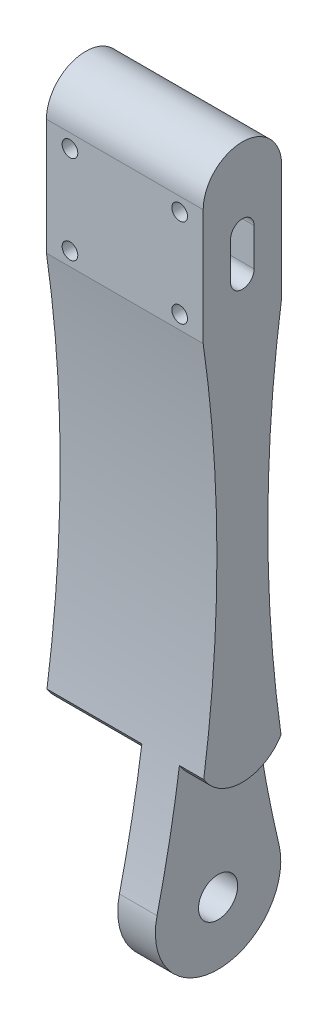
ISO-10303-21;
HEADER;
FILE_DESCRIPTION(('STEP AP214'),'2;1');
FILE_NAME('part.step','',(''),(''),'','','');
FILE_SCHEMA(('AUTOMOTIVE_DESIGN { 1 0 10303 214 1 1 1 1 }'));
ENDSEC;
DATA;
#1=APPLICATION_CONTEXT('core data for automotive mechanical design processes');
#2=APPLICATION_PROTOCOL_DEFINITION('international standard','automotive_design',2000,#1);
#3=PRODUCT_CONTEXT('',#1,'mechanical');
#4=PRODUCT('Part','Part','',(#3));
#5=PRODUCT_RELATED_PRODUCT_CATEGORY('part','',(#4));
#6=PRODUCT_DEFINITION_FORMATION('','',#4);
#7=PRODUCT_DEFINITION_CONTEXT('part definition',#1,'design');
#8=PRODUCT_DEFINITION('design','',#6,#7);
#9=PRODUCT_DEFINITION_SHAPE('','',#8);
#10=(LENGTH_UNIT() NAMED_UNIT(*) SI_UNIT(.MILLI.,.METRE.));
#11=(NAMED_UNIT(*) PLANE_ANGLE_UNIT() SI_UNIT($,.RADIAN.));
#12=(NAMED_UNIT(*) SI_UNIT($,.STERADIAN.) SOLID_ANGLE_UNIT());
#13=UNCERTAINTY_MEASURE_WITH_UNIT(LENGTH_MEASURE(1.E-05),#10,'distance_accuracy_value','');
#14=(GEOMETRIC_REPRESENTATION_CONTEXT(3) GLOBAL_UNCERTAINTY_ASSIGNED_CONTEXT((#13)) GLOBAL_UNIT_ASSIGNED_CONTEXT((#10,
#11,#12)) REPRESENTATION_CONTEXT('',''));
#15=CARTESIAN_POINT('',(0.,0.,0.));
#16=DIRECTION('',(0.,0.,1.));
#17=DIRECTION('',(1.,0.,0.));
#18=AXIS2_PLACEMENT_3D('',#15,#16,#17);
#19=CARTESIAN_POINT('',(12.1,-40.7298826777088,-8.00000000000003));
#20=DIRECTION('',(1.,0.,0.));
#21=DIRECTION('',(0.,1.,0.));
#22=AXIS2_PLACEMENT_3D('',#19,#20,#21);
#23=PLANE('',#22);
#24=DIRECTION('',(0.,1.,0.));
#25=VECTOR('',#24,1.);
#26=CARTESIAN_POINT('',(12.1,-53.2273833717677,2.5));
#27=LINE('',#26,#25);
#28=CARTESIAN_POINT('',(12.1,-53.2273833717677,2.50000000000001));
#29=VERTEX_POINT('',#28);
#30=CARTESIAN_POINT('',(12.1,-42.9311075549303,2.5));
#31=VERTEX_POINT('',#30);
#32=EDGE_CURVE('E173',#29,#31,#27,.T.);
#33=ORIENTED_EDGE('',*,*,#32,.F.);
#34=CARTESIAN_POINT('',(12.1,-57.7298826777088,0.));
#35=DIRECTION('',(-1.,0.,0.));
#36=DIRECTION('',(0.,-1.,0.));
#37=AXIS2_PLACEMENT_3D('',#34,#35,#36);
#38=CIRCLE('',#37,5.15);
#39=CARTESIAN_POINT('',(12.1,-53.2273833717677,-2.5));
#40=VERTEX_POINT('',#39);
#41=EDGE_CURVE('E167',#40,#29,#38,.T.);
#42=ORIENTED_EDGE('',*,*,#41,.F.);
#43=DIRECTION('',(0.,-1.,0.));
#44=VECTOR('',#43,1.);
#45=CARTESIAN_POINT('',(12.1,-53.2273833717677,-2.5));
#46=LINE('',#45,#44);
#47=CARTESIAN_POINT('',(12.1,-42.9311075549303,-2.5));
#48=VERTEX_POINT('',#47);
#49=EDGE_CURVE('E328',#48,#40,#46,.T.);
#50=ORIENTED_EDGE('',*,*,#49,.F.);
#51=CARTESIAN_POINT('',(12.1,-37.7298826777088,0.));
#52=DIRECTION('',(1.,0.,0.));
#53=DIRECTION('',(0.,1.,0.));
#54=AXIS2_PLACEMENT_3D('',#51,#52,#53);
#55=CIRCLE('',#54,5.77085264267143);
#56=CARTESIAN_POINT('',(12.1,-40.7298826777088,-4.9297809508565));
#57=VERTEX_POINT('',#56);
#58=EDGE_CURVE('E182',#48,#57,#55,.T.);
#59=ORIENTED_EDGE('',*,*,#58,.T.);
#60=CARTESIAN_POINT('',(12.1,-16.8722504661705,-173.247377729265));
#61=DIRECTION('',(1.,0.,0.));
#62=DIRECTION('',(0.,1.,0.));
#63=AXIS2_PLACEMENT_3D('',#60,#61,#62);
#64=CIRCLE('',#63,170.);
#65=CARTESIAN_POINT('',(12.1,-55.8935846007857,-7.78639899906813));
#66=VERTEX_POINT('',#65);
#67=EDGE_CURVE('E198',#66,#57,#64,.F.);
#68=ORIENTED_EDGE('',*,*,#67,.F.);
#69=CARTESIAN_POINT('',(12.1,-57.7298826777088,0.));
#70=DIRECTION('',(1.,0.,0.));
#71=DIRECTION('',(0.,1.,0.));
#72=AXIS2_PLACEMENT_3D('',#69,#70,#71);
#73=CIRCLE('',#72,8.00000000000003);
#74=CARTESIAN_POINT('',(12.1,-55.8935846007857,7.78639899906812));
#75=VERTEX_POINT('',#74);
#76=EDGE_CURVE('E201',#75,#66,#73,.T.);
#77=ORIENTED_EDGE('',*,*,#76,.F.);
#78=CARTESIAN_POINT('',(12.1,-16.8722504661702,173.247377729265));
#79=DIRECTION('',(1.,0.,0.));
#80=DIRECTION('',(0.,1.,0.));
#81=AXIS2_PLACEMENT_3D('',#78,#79,#80);
#82=CIRCLE('',#81,170.);
#83=CARTESIAN_POINT('',(12.1,-40.7298826777088,4.92978095085653));
#84=VERTEX_POINT('',#83);
#85=EDGE_CURVE('E203',#84,#75,#82,.F.);
#86=ORIENTED_EDGE('',*,*,#85,.F.);
#87=EDGE_CURVE('E41',#84,#31,#55,.T.);
#88=ORIENTED_EDGE('',*,*,#87,.T.);
#89=EDGE_LOOP('',(#33,#42,#50,#59,#68,#77,#86,#88));
#90=FACE_BOUND('',#89,.T.);
#91=ADVANCED_FACE('F33',(#90),#23,.F.);
#92=CARTESIAN_POINT('',(0.,-37.7298826777088,0.));
#93=DIRECTION('',(1.,0.,0.));
#94=DIRECTION('',(0.,0.,-1.));
#95=AXIS2_PLACEMENT_3D('',#92,#93,#94);
#96=CYLINDRICAL_SURFACE('',#95,5.77085264267143);
#97=CARTESIAN_POINT('',(10.1,-37.7298826777088,0.));
#98=DIRECTION('',(-1.,0.,0.));
#99=DIRECTION('',(0.,-1.,0.));
#100=AXIS2_PLACEMENT_3D('',#97,#98,#99);
#101=CIRCLE('',#100,5.77085264267143);
#102=CARTESIAN_POINT('',(10.1,-42.9311075549303,2.5));
#103=VERTEX_POINT('',#102);
#104=CARTESIAN_POINT('',(10.1,-42.9311075549303,-2.5));
#105=VERTEX_POINT('',#104);
#106=EDGE_CURVE('E11',#103,#105,#101,.F.);
#107=ORIENTED_EDGE('',*,*,#106,.F.);
#108=DIRECTION('',(1.,0.,0.));
#109=VECTOR('',#108,1.);
#110=CARTESIAN_POINT('',(10.1,-42.9311075549303,2.5));
#111=LINE('',#110,#109);
#112=EDGE_CURVE('E170',#103,#31,#111,.T.);
#113=ORIENTED_EDGE('',*,*,#112,.T.);
#114=ORIENTED_EDGE('',*,*,#87,.F.);
#115=DIRECTION('',(-1.,0.,0.));
#116=VECTOR('',#115,1.);
#117=CARTESIAN_POINT('',(20.,-40.7298826777088,4.92978095085653));
#118=LINE('',#117,#116);
#119=CARTESIAN_POINT('',(0.,-40.7298826777088,4.92978095085653));
#120=VERTEX_POINT('',#119);
#121=EDGE_CURVE('E235',#120,#84,#118,.F.);
#122=ORIENTED_EDGE('',*,*,#121,.F.);
#123=CARTESIAN_POINT('',(0.,-37.7298826777088,0.));
#124=DIRECTION('',(1.,0.,0.));
#125=DIRECTION('',(0.,0.,-1.));
#126=AXIS2_PLACEMENT_3D('',#123,#124,#125);
#127=CIRCLE('',#126,5.77085264267143);
#128=CARTESIAN_POINT('',(0.,-40.7298826777088,-4.9297809508565));
#129=VERTEX_POINT('',#128);
#130=EDGE_CURVE('E191',#120,#129,#127,.T.);
#131=ORIENTED_EDGE('',*,*,#130,.T.);
#132=DIRECTION('',(-1.,0.,0.));
#133=VECTOR('',#132,1.);
#134=CARTESIAN_POINT('',(20.,-40.7298826777088,-4.9297809508565));
#135=LINE('',#134,#133);
#136=EDGE_CURVE('E309',#57,#129,#135,.T.);
#137=ORIENTED_EDGE('',*,*,#136,.F.);
#138=ORIENTED_EDGE('',*,*,#58,.F.);
#139=DIRECTION('',(1.,0.,0.));
#140=VECTOR('',#139,1.);
#141=CARTESIAN_POINT('',(10.1,-42.9311075549303,-2.5));
#142=LINE('',#141,#140);
#143=EDGE_CURVE('E177',#105,#48,#142,.T.);
#144=ORIENTED_EDGE('',*,*,#143,.F.);
#145=EDGE_LOOP('',(#107,#113,#114,#122,#131,#137,#138,#144));
#146=FACE_BOUND('',#145,.T.);
#147=ADVANCED_FACE('F179',(#146),#96,.T.);
#148=CARTESIAN_POINT('',(20.,22.2701173222912,0.));
#149=DIRECTION('',(1.,0.,0.));
#150=DIRECTION('',(0.,0.,-1.));
#151=AXIS2_PLACEMENT_3D('',#148,#149,#150);
#152=PLANE('',#151);
#153=CARTESIAN_POINT('',(20.,-16.8722504661702,173.247377729265));
#154=DIRECTION('',(-1.,0.,0.));
#155=DIRECTION('',(0.,0.,-1.));
#156=AXIS2_PLACEMENT_3D('',#153,#154,#155);
#157=CIRCLE('',#156,170.);
#158=CARTESIAN_POINT('',(20.,7.47564240417795,4.99999999999998));
#159=VERTEX_POINT('',#158);
#160=CARTESIAN_POINT('',(20.,-40.7298826777088,4.92978095085653));
#161=VERTEX_POINT('',#160);
#162=EDGE_CURVE('E274',#159,#161,#157,.T.);
#163=ORIENTED_EDGE('',*,*,#162,.T.);
#164=CARTESIAN_POINT('',(20.,-37.7298826777088,0.));
#165=DIRECTION('',(1.,0.,0.));
#166=DIRECTION('',(0.,0.,-1.));
#167=AXIS2_PLACEMENT_3D('',#164,#165,#166);
#168=CIRCLE('',#167,5.77085264267143);
#169=CARTESIAN_POINT('',(20.,-40.7298826777088,-4.9297809508565));
#170=VERTEX_POINT('',#169);
#171=EDGE_CURVE('E176',#161,#170,#168,.T.);
#172=ORIENTED_EDGE('',*,*,#171,.T.);
#173=CARTESIAN_POINT('',(20.,-16.8722504661705,-173.247377729265));
#174=DIRECTION('',(-1.,0.,0.));
#175=DIRECTION('',(0.,0.,-1.));
#176=AXIS2_PLACEMENT_3D('',#173,#174,#175);
#177=CIRCLE('',#176,170.);
#178=CARTESIAN_POINT('',(20.,7.47564240417789,-5.));
#179=VERTEX_POINT('',#178);
#180=EDGE_CURVE('E277',#170,#179,#177,.T.);
#181=ORIENTED_EDGE('',*,*,#180,.T.);
#182=DIRECTION('',(0.,1.,0.));
#183=VECTOR('',#182,1.);
#184=CARTESIAN_POINT('',(20.,22.2701173222912,-5.));
#185=LINE('',#184,#183);
#186=CARTESIAN_POINT('',(20.,22.2701173222912,-5.));
#187=VERTEX_POINT('',#186);
#188=EDGE_CURVE('E279',#179,#187,#185,.T.);
#189=ORIENTED_EDGE('',*,*,#188,.T.);
#190=CARTESIAN_POINT('',(20.,22.2701173222912,0.));
#191=DIRECTION('',(1.,0.,0.));
#192=DIRECTION('',(0.,0.,-1.));
#193=AXIS2_PLACEMENT_3D('',#190,#191,#192);
#194=CIRCLE('',#193,5.);
#195=CARTESIAN_POINT('',(20.,22.2701173222912,5.));
#196=VERTEX_POINT('',#195);
#197=EDGE_CURVE('E268',#187,#196,#194,.T.);
#198=ORIENTED_EDGE('',*,*,#197,.T.);
#199=DIRECTION('',(0.,-1.,0.));
#200=VECTOR('',#199,1.);
#201=CARTESIAN_POINT('',(20.,22.2701173222912,5.));
#202=LINE('',#201,#200);
#203=EDGE_CURVE('E271',#196,#159,#202,.T.);
#204=ORIENTED_EDGE('',*,*,#203,.T.);
#205=EDGE_LOOP('',(#163,#172,#181,#189,#198,#204));
#206=FACE_BOUND('',#205,.T.);
#207=DIRECTION('',(0.,1.,0.));
#208=VECTOR('',#207,1.);
#209=CARTESIAN_POINT('',(20.,12.4756424041779,-1.5));
#210=LINE('',#209,#208);
#211=CARTESIAN_POINT('',(20.,12.4756424041779,-1.5));
#212=VERTEX_POINT('',#211);
#213=CARTESIAN_POINT('',(20.,17.2701173222912,-1.5));
#214=VERTEX_POINT('',#213);
#215=EDGE_CURVE('E241',#212,#214,#210,.T.);
#216=ORIENTED_EDGE('',*,*,#215,.F.);
#217=CARTESIAN_POINT('',(20.,12.4756424041779,0.));
#218=DIRECTION('',(1.,0.,0.));
#219=DIRECTION('',(0.,0.,-1.));
#220=AXIS2_PLACEMENT_3D('',#217,#218,#219);
#221=CIRCLE('',#220,1.5);
#222=CARTESIAN_POINT('',(20.,12.4756424041779,1.5));
#223=VERTEX_POINT('',#222);
#224=EDGE_CURVE('E239',#223,#212,#221,.T.);
#225=ORIENTED_EDGE('',*,*,#224,.F.);
#226=DIRECTION('',(0.,-1.,0.));
#227=VECTOR('',#226,1.);
#228=CARTESIAN_POINT('',(20.,12.4756424041779,1.5));
#229=LINE('',#228,#227);
#230=CARTESIAN_POINT('',(20.,17.2701173222912,1.5));
#231=VERTEX_POINT('',#230);
#232=EDGE_CURVE('E246',#231,#223,#229,.T.);
#233=ORIENTED_EDGE('',*,*,#232,.F.);
#234=CARTESIAN_POINT('',(20.,17.2701173222912,0.));
#235=DIRECTION('',(1.,0.,0.));
#236=DIRECTION('',(0.,0.,-1.));
#237=AXIS2_PLACEMENT_3D('',#234,#235,#236);
#238=CIRCLE('',#237,1.5);
#239=EDGE_CURVE('E244',#214,#231,#238,.T.);
#240=ORIENTED_EDGE('',*,*,#239,.F.);
#241=EDGE_LOOP('',(#216,#225,#233,#240));
#242=FACE_BOUND('',#241,.T.);
#243=ADVANCED_FACE('F354',(#206,#242),#152,.T.);
#244=CARTESIAN_POINT('',(0.,22.2701173222912,0.));
#245=DIRECTION('',(1.,0.,0.));
#246=DIRECTION('',(0.,0.,-1.));
#247=AXIS2_PLACEMENT_3D('',#244,#245,#246);
#248=PLANE('',#247);
#249=CARTESIAN_POINT('',(0.,-16.8722504661705,-173.247377729265));
#250=DIRECTION('',(-1.,0.,0.));
#251=DIRECTION('',(0.,0.,-1.));
#252=AXIS2_PLACEMENT_3D('',#249,#250,#251);
#253=CIRCLE('',#252,170.);
#254=CARTESIAN_POINT('',(0.,7.47564240417789,-5.));
#255=VERTEX_POINT('',#254);
#256=EDGE_CURVE('E289',#129,#255,#253,.T.);
#257=ORIENTED_EDGE('',*,*,#256,.F.);
#258=ORIENTED_EDGE('',*,*,#130,.F.);
#259=CARTESIAN_POINT('',(0.,-16.8722504661702,173.247377729265));
#260=DIRECTION('',(-1.,0.,0.));
#261=DIRECTION('',(0.,0.,-1.));
#262=AXIS2_PLACEMENT_3D('',#259,#260,#261);
#263=CIRCLE('',#262,170.);
#264=CARTESIAN_POINT('',(0.,7.47564240417795,4.99999999999998));
#265=VERTEX_POINT('',#264);
#266=EDGE_CURVE('E286',#265,#120,#263,.T.);
#267=ORIENTED_EDGE('',*,*,#266,.F.);
#268=DIRECTION('',(0.,-1.,0.));
#269=VECTOR('',#268,1.);
#270=CARTESIAN_POINT('',(0.,22.2701173222912,5.));
#271=LINE('',#270,#269);
#272=CARTESIAN_POINT('',(0.,22.2701173222912,5.));
#273=VERTEX_POINT('',#272);
#274=EDGE_CURVE('E284',#273,#265,#271,.T.);
#275=ORIENTED_EDGE('',*,*,#274,.F.);
#276=CARTESIAN_POINT('',(0.,22.2701173222912,0.));
#277=DIRECTION('',(1.,0.,0.));
#278=DIRECTION('',(0.,0.,-1.));
#279=AXIS2_PLACEMENT_3D('',#276,#277,#278);
#280=CIRCLE('',#279,5.);
#281=CARTESIAN_POINT('',(0.,22.2701173222912,-5.));
#282=VERTEX_POINT('',#281);
#283=EDGE_CURVE('E267',#282,#273,#280,.T.);
#284=ORIENTED_EDGE('',*,*,#283,.F.);
#285=DIRECTION('',(0.,1.,0.));
#286=VECTOR('',#285,1.);
#287=CARTESIAN_POINT('',(0.,22.2701173222912,-5.));
#288=LINE('',#287,#286);
#289=EDGE_CURVE('E272',#255,#282,#288,.T.);
#290=ORIENTED_EDGE('',*,*,#289,.F.);
#291=EDGE_LOOP('',(#257,#258,#267,#275,#284,#290));
#292=FACE_BOUND('',#291,.T.);
#293=CARTESIAN_POINT('',(0.,12.4756424041779,0.));
#294=DIRECTION('',(1.,0.,0.));
#295=DIRECTION('',(0.,0.,-1.));
#296=AXIS2_PLACEMENT_3D('',#293,#294,#295);
#297=CIRCLE('',#296,1.5);
#298=CARTESIAN_POINT('',(0.,12.4756424041779,1.5));
#299=VERTEX_POINT('',#298);
#300=CARTESIAN_POINT('',(0.,12.4756424041779,-1.5));
#301=VERTEX_POINT('',#300);
#302=EDGE_CURVE('E238',#299,#301,#297,.T.);
#303=ORIENTED_EDGE('',*,*,#302,.T.);
#304=DIRECTION('',(0.,1.,0.));
#305=VECTOR('',#304,1.);
#306=CARTESIAN_POINT('',(0.,12.4756424041779,-1.5));
#307=LINE('',#306,#305);
#308=CARTESIAN_POINT('',(0.,17.2701173222912,-1.5));
#309=VERTEX_POINT('',#308);
#310=EDGE_CURVE('E251',#301,#309,#307,.T.);
#311=ORIENTED_EDGE('',*,*,#310,.T.);
#312=CARTESIAN_POINT('',(0.,17.2701173222912,0.));
#313=DIRECTION('',(1.,0.,0.));
#314=DIRECTION('',(0.,0.,-1.));
#315=AXIS2_PLACEMENT_3D('',#312,#313,#314);
#316=CIRCLE('',#315,1.5);
#317=CARTESIAN_POINT('',(0.,17.2701173222912,1.5));
#318=VERTEX_POINT('',#317);
#319=EDGE_CURVE('E254',#309,#318,#316,.T.);
#320=ORIENTED_EDGE('',*,*,#319,.T.);
#321=DIRECTION('',(0.,-1.,0.));
#322=VECTOR('',#321,1.);
#323=CARTESIAN_POINT('',(0.,12.4756424041779,1.5));
#324=LINE('',#323,#322);
#325=EDGE_CURVE('E242',#318,#299,#324,.T.);
#326=ORIENTED_EDGE('',*,*,#325,.T.);
#327=EDGE_LOOP('',(#303,#311,#320,#326));
#328=FACE_BOUND('',#327,.T.);
#329=ADVANCED_FACE('F342',(#292,#328),#248,.F.);
#330=CARTESIAN_POINT('',(20.,22.2701173222912,0.));
#331=DIRECTION('',(-1.,0.,0.));
#332=DIRECTION('',(0.,0.,1.));
#333=AXIS2_PLACEMENT_3D('',#330,#331,#332);
#334=CYLINDRICAL_SURFACE('',#333,5.);
#335=ORIENTED_EDGE('',*,*,#283,.T.);
#336=DIRECTION('',(-1.,0.,0.));
#337=VECTOR('',#336,1.);
#338=CARTESIAN_POINT('',(20.,22.2701173222912,5.));
#339=LINE('',#338,#337);
#340=EDGE_CURVE('E306',#196,#273,#339,.T.);
#341=ORIENTED_EDGE('',*,*,#340,.F.);
#342=ORIENTED_EDGE('',*,*,#197,.F.);
#343=DIRECTION('',(-1.,0.,0.));
#344=VECTOR('',#343,1.);
#345=CARTESIAN_POINT('',(20.,22.2701173222912,-5.));
#346=LINE('',#345,#344);
#347=EDGE_CURVE('E281',#187,#282,#346,.T.);
#348=ORIENTED_EDGE('',*,*,#347,.T.);
#349=EDGE_LOOP('',(#335,#341,#342,#348));
#350=FACE_BOUND('',#349,.T.);
#351=ADVANCED_FACE('F35',(#350),#334,.T.);
#352=CARTESIAN_POINT('',(20.,22.2701173222912,5.));
#353=DIRECTION('',(0.,0.,-1.));
#354=DIRECTION('',(0.,1.,0.));
#355=AXIS2_PLACEMENT_3D('',#352,#353,#354);
#356=PLANE('',#355);
#357=CARTESIAN_POINT('',(17.,20.5201173222912,5.));
#358=DIRECTION('',(0.,0.,-1.));
#359=DIRECTION('',(0.,1.,0.));
#360=AXIS2_PLACEMENT_3D('',#357,#358,#359);
#361=CIRCLE('',#360,1.);
#362=CARTESIAN_POINT('',(17.,21.5201173222912,5.));
#363=VERTEX_POINT('',#362);
#364=EDGE_CURVE('E207',#363,#363,#361,.F.);
#365=ORIENTED_EDGE('',*,*,#364,.F.);
#366=EDGE_LOOP('',(#365));
#367=FACE_BOUND('',#366,.T.);
#368=CARTESIAN_POINT('',(3.,20.5201173222912,5.));
#369=DIRECTION('',(0.,0.,-1.));
#370=DIRECTION('',(0.,1.,0.));
#371=AXIS2_PLACEMENT_3D('',#368,#369,#370);
#372=CIRCLE('',#371,1.);
#373=CARTESIAN_POINT('',(3.,21.5201173222912,5.));
#374=VERTEX_POINT('',#373);
#375=EDGE_CURVE('E211',#374,#374,#372,.F.);
#376=ORIENTED_EDGE('',*,*,#375,.F.);
#377=EDGE_LOOP('',(#376));
#378=FACE_BOUND('',#377,.T.);
#379=CARTESIAN_POINT('',(17.,9.22564240417789,5.));
#380=DIRECTION('',(0.,0.,-1.));
#381=DIRECTION('',(0.,1.,0.));
#382=AXIS2_PLACEMENT_3D('',#379,#380,#381);
#383=CIRCLE('',#382,1.);
#384=CARTESIAN_POINT('',(17.,10.2256424041779,5.));
#385=VERTEX_POINT('',#384);
#386=EDGE_CURVE('E215',#385,#385,#383,.F.);
#387=ORIENTED_EDGE('',*,*,#386,.F.);
#388=EDGE_LOOP('',(#387));
#389=FACE_BOUND('',#388,.T.);
#390=CARTESIAN_POINT('',(3.,9.22564240417789,5.));
#391=DIRECTION('',(0.,0.,-1.));
#392=DIRECTION('',(0.,1.,0.));
#393=AXIS2_PLACEMENT_3D('',#390,#391,#392);
#394=CIRCLE('',#393,1.);
#395=CARTESIAN_POINT('',(3.,10.2256424041779,5.));
#396=VERTEX_POINT('',#395);
#397=EDGE_CURVE('E219',#396,#396,#394,.F.);
#398=ORIENTED_EDGE('',*,*,#397,.F.);
#399=EDGE_LOOP('',(#398));
#400=FACE_BOUND('',#399,.T.);
#401=ORIENTED_EDGE('',*,*,#274,.T.);
#402=DIRECTION('',(-1.,0.,0.));
#403=VECTOR('',#402,1.);
#404=CARTESIAN_POINT('',(20.,7.47564240417795,4.99999999999998));
#405=LINE('',#404,#403);
#406=EDGE_CURVE('E303',#159,#265,#405,.T.);
#407=ORIENTED_EDGE('',*,*,#406,.F.);
#408=ORIENTED_EDGE('',*,*,#203,.F.);
#409=ORIENTED_EDGE('',*,*,#340,.T.);
#410=EDGE_LOOP('',(#401,#407,#408,#409));
#411=FACE_BOUND('',#410,.T.);
#412=ADVANCED_FACE('F364',(#367,#378,#389,#400,#411),#356,.F.);
#413=CARTESIAN_POINT('',(20.,-16.8722504661702,173.247377729265));
#414=DIRECTION('',(-1.,0.,0.));
#415=DIRECTION('',(0.,0.,1.));
#416=AXIS2_PLACEMENT_3D('',#413,#414,#415);
#417=CYLINDRICAL_SURFACE('',#416,170.);
#418=ORIENTED_EDGE('',*,*,#121,.T.);
#419=ORIENTED_EDGE('',*,*,#85,.T.);
#420=DIRECTION('',(-1.,0.,0.));
#421=VECTOR('',#420,1.);
#422=CARTESIAN_POINT('',(20.,-55.8935846007857,7.78639899906812));
#423=LINE('',#422,#421);
#424=CARTESIAN_POINT('',(16.9,-55.8935846007857,7.78639899906812));
#425=VERTEX_POINT('',#424);
#426=EDGE_CURVE('E300',#425,#75,#423,.T.);
#427=ORIENTED_EDGE('',*,*,#426,.F.);
#428=CARTESIAN_POINT('',(16.9,-16.8722504661702,173.247377729265));
#429=DIRECTION('',(-1.,0.,0.));
#430=DIRECTION('',(0.,0.,1.));
#431=AXIS2_PLACEMENT_3D('',#428,#429,#430);
#432=CIRCLE('',#431,170.);
#433=CARTESIAN_POINT('',(16.9,-40.7298826777088,4.92978095085653));
#434=VERTEX_POINT('',#433);
#435=EDGE_CURVE('E229',#425,#434,#432,.F.);
#436=ORIENTED_EDGE('',*,*,#435,.T.);
#437=DIRECTION('',(-1.,0.,0.));
#438=VECTOR('',#437,1.);
#439=CARTESIAN_POINT('',(20.,-40.7298826777088,4.92978095085653));
#440=LINE('',#439,#438);
#441=EDGE_CURVE('E232',#434,#161,#440,.F.);
#442=ORIENTED_EDGE('',*,*,#441,.T.);
#443=ORIENTED_EDGE('',*,*,#162,.F.);
#444=ORIENTED_EDGE('',*,*,#406,.T.);
#445=ORIENTED_EDGE('',*,*,#266,.T.);
#446=EDGE_LOOP('',(#418,#419,#427,#436,#442,#443,#444,#445));
#447=FACE_BOUND('',#446,.T.);
#448=ADVANCED_FACE('F339',(#447),#417,.F.);
#449=CARTESIAN_POINT('',(20.,-57.7298826777088,0.));
#450=DIRECTION('',(-1.,0.,0.));
#451=DIRECTION('',(0.,0.,1.));
#452=AXIS2_PLACEMENT_3D('',#449,#450,#451);
#453=CYLINDRICAL_SURFACE('',#452,8.00000000000003);
#454=ORIENTED_EDGE('',*,*,#76,.T.);
#455=DIRECTION('',(-1.,0.,0.));
#456=VECTOR('',#455,1.);
#457=CARTESIAN_POINT('',(20.,-55.8935846007857,-7.78639899906813));
#458=LINE('',#457,#456);
#459=CARTESIAN_POINT('',(16.9,-55.8935846007857,-7.78639899906813));
#460=VERTEX_POINT('',#459);
#461=EDGE_CURVE('E297',#460,#66,#458,.T.);
#462=ORIENTED_EDGE('',*,*,#461,.F.);
#463=CARTESIAN_POINT('',(16.9,-57.7298826777088,0.));
#464=DIRECTION('',(-1.,0.,0.));
#465=DIRECTION('',(0.,0.,1.));
#466=AXIS2_PLACEMENT_3D('',#463,#464,#465);
#467=CIRCLE('',#466,8.00000000000003);
#468=EDGE_CURVE('E226',#460,#425,#467,.T.);
#469=ORIENTED_EDGE('',*,*,#468,.T.);
#470=ORIENTED_EDGE('',*,*,#426,.T.);
#471=EDGE_LOOP('',(#454,#462,#469,#470));
#472=FACE_BOUND('',#471,.T.);
#473=ADVANCED_FACE('F336',(#472),#453,.T.);
#474=CARTESIAN_POINT('',(20.,-16.8722504661705,-173.247377729265));
#475=DIRECTION('',(-1.,0.,0.));
#476=DIRECTION('',(0.,0.,1.));
#477=AXIS2_PLACEMENT_3D('',#474,#475,#476);
#478=CYLINDRICAL_SURFACE('',#477,170.);
#479=DIRECTION('',(-1.,0.,0.));
#480=VECTOR('',#479,1.);
#481=CARTESIAN_POINT('',(20.,-40.7298826777088,-4.9297809508565));
#482=LINE('',#481,#480);
#483=CARTESIAN_POINT('',(16.9,-40.7298826777088,-4.9297809508565));
#484=VERTEX_POINT('',#483);
#485=EDGE_CURVE('E312',#170,#484,#482,.T.);
#486=ORIENTED_EDGE('',*,*,#485,.T.);
#487=CARTESIAN_POINT('',(16.9,-16.8722504661705,-173.247377729265));
#488=DIRECTION('',(-1.,0.,0.));
#489=DIRECTION('',(0.,0.,1.));
#490=AXIS2_PLACEMENT_3D('',#487,#488,#489);
#491=CIRCLE('',#490,170.);
#492=EDGE_CURVE('E223',#484,#460,#491,.F.);
#493=ORIENTED_EDGE('',*,*,#492,.T.);
#494=ORIENTED_EDGE('',*,*,#461,.T.);
#495=ORIENTED_EDGE('',*,*,#67,.T.);
#496=ORIENTED_EDGE('',*,*,#136,.T.);
#497=ORIENTED_EDGE('',*,*,#256,.T.);
#498=DIRECTION('',(-1.,0.,0.));
#499=VECTOR('',#498,1.);
#500=CARTESIAN_POINT('',(20.,7.47564240417789,-5.));
#501=LINE('',#500,#499);
#502=EDGE_CURVE('E294',#179,#255,#501,.T.);
#503=ORIENTED_EDGE('',*,*,#502,.F.);
#504=ORIENTED_EDGE('',*,*,#180,.F.);
#505=EDGE_LOOP('',(#486,#493,#494,#495,#496,#497,#503,#504));
#506=FACE_BOUND('',#505,.T.);
#507=ADVANCED_FACE('F332',(#506),#478,.F.);
#508=CARTESIAN_POINT('',(20.,22.2701173222912,-5.));
#509=DIRECTION('',(0.,0.,1.));
#510=DIRECTION('',(0.,-1.,0.));
#511=AXIS2_PLACEMENT_3D('',#508,#509,#510);
#512=PLANE('',#511);
#513=CARTESIAN_POINT('',(17.,20.5201173222912,-5.));
#514=DIRECTION('',(0.,0.,1.));
#515=DIRECTION('',(0.,-1.,0.));
#516=AXIS2_PLACEMENT_3D('',#513,#514,#515);
#517=CIRCLE('',#516,1.);
#518=CARTESIAN_POINT('',(17.,19.5201173222912,-5.));
#519=VERTEX_POINT('',#518);
#520=EDGE_CURVE('E206',#519,#519,#517,.F.);
#521=ORIENTED_EDGE('',*,*,#520,.F.);
#522=EDGE_LOOP('',(#521));
#523=FACE_BOUND('',#522,.T.);
#524=CARTESIAN_POINT('',(3.,20.5201173222912,-5.));
#525=DIRECTION('',(0.,0.,1.));
#526=DIRECTION('',(0.,-1.,0.));
#527=AXIS2_PLACEMENT_3D('',#524,#525,#526);
#528=CIRCLE('',#527,1.);
#529=CARTESIAN_POINT('',(3.,19.5201173222912,-5.));
#530=VERTEX_POINT('',#529);
#531=EDGE_CURVE('E210',#530,#530,#528,.F.);
#532=ORIENTED_EDGE('',*,*,#531,.F.);
#533=EDGE_LOOP('',(#532));
#534=FACE_BOUND('',#533,.T.);
#535=CARTESIAN_POINT('',(17.,9.2256424041779,-5.));
#536=DIRECTION('',(0.,0.,1.));
#537=DIRECTION('',(0.,-1.,0.));
#538=AXIS2_PLACEMENT_3D('',#535,#536,#537);
#539=CIRCLE('',#538,1.);
#540=CARTESIAN_POINT('',(17.,8.22564240417789,-5.));
#541=VERTEX_POINT('',#540);
#542=EDGE_CURVE('E214',#541,#541,#539,.F.);
#543=ORIENTED_EDGE('',*,*,#542,.F.);
#544=EDGE_LOOP('',(#543));
#545=FACE_BOUND('',#544,.T.);
#546=CARTESIAN_POINT('',(3.,9.2256424041779,-5.));
#547=DIRECTION('',(0.,0.,1.));
#548=DIRECTION('',(0.,-1.,0.));
#549=AXIS2_PLACEMENT_3D('',#546,#547,#548);
#550=CIRCLE('',#549,1.);
#551=CARTESIAN_POINT('',(3.,8.22564240417789,-5.));
#552=VERTEX_POINT('',#551);
#553=EDGE_CURVE('E218',#552,#552,#550,.F.);
#554=ORIENTED_EDGE('',*,*,#553,.F.);
#555=EDGE_LOOP('',(#554));
#556=FACE_BOUND('',#555,.T.);
#557=ORIENTED_EDGE('',*,*,#289,.T.);
#558=ORIENTED_EDGE('',*,*,#347,.F.);
#559=ORIENTED_EDGE('',*,*,#188,.F.);
#560=ORIENTED_EDGE('',*,*,#502,.T.);
#561=EDGE_LOOP('',(#557,#558,#559,#560));
#562=FACE_BOUND('',#561,.T.);
#563=ADVANCED_FACE('F350',(#523,#534,#545,#556,#562),#512,.F.);
#564=CARTESIAN_POINT('',(20.,-57.7298826777088,0.));
#565=DIRECTION('',(-1.,0.,0.));
#566=DIRECTION('',(0.,0.,1.));
#567=AXIS2_PLACEMENT_3D('',#564,#565,#566);
#568=CYLINDRICAL_SURFACE('',#567,2.5);
#569=CARTESIAN_POINT('',(16.9,-57.7298826777088,0.));
#570=DIRECTION('',(-1.,0.,0.));
#571=DIRECTION('',(0.,0.,1.));
#572=AXIS2_PLACEMENT_3D('',#569,#570,#571);
#573=CIRCLE('',#572,2.5);
#574=CARTESIAN_POINT('',(16.9,-57.7298826777088,2.5));
#575=VERTEX_POINT('',#574);
#576=EDGE_CURVE('E222',#575,#575,#573,.T.);
#577=ORIENTED_EDGE('',*,*,#576,.F.);
#578=EDGE_LOOP('',(#577));
#579=FACE_BOUND('',#578,.T.);
#580=CARTESIAN_POINT('',(10.1,-57.7298826777088,0.));
#581=DIRECTION('',(-1.,0.,0.));
#582=DIRECTION('',(0.,-1.,0.));
#583=AXIS2_PLACEMENT_3D('',#580,#581,#582);
#584=CIRCLE('',#583,2.5);
#585=CARTESIAN_POINT('',(10.1,-60.2298826777088,0.));
#586=VERTEX_POINT('',#585);
#587=EDGE_CURVE('E596',#586,#586,#584,.T.);
#588=ORIENTED_EDGE('',*,*,#587,.T.);
#589=EDGE_LOOP('',(#588));
#590=FACE_BOUND('',#589,.T.);
#591=ADVANCED_FACE('F414',(#579,#590),#568,.F.);
#592=CARTESIAN_POINT('',(20.,12.4756424041779,0.));
#593=DIRECTION('',(-1.,0.,0.));
#594=DIRECTION('',(0.,0.,1.));
#595=AXIS2_PLACEMENT_3D('',#592,#593,#594);
#596=CYLINDRICAL_SURFACE('',#595,1.5);
#597=ORIENTED_EDGE('',*,*,#302,.F.);
#598=DIRECTION('',(-1.,0.,0.));
#599=VECTOR('',#598,1.);
#600=CARTESIAN_POINT('',(20.,12.4756424041779,1.5));
#601=LINE('',#600,#599);
#602=EDGE_CURVE('E248',#223,#299,#601,.T.);
#603=ORIENTED_EDGE('',*,*,#602,.F.);
#604=ORIENTED_EDGE('',*,*,#224,.T.);
#605=DIRECTION('',(-1.,0.,0.));
#606=VECTOR('',#605,1.);
#607=CARTESIAN_POINT('',(20.,12.4756424041779,-1.5));
#608=LINE('',#607,#606);
#609=EDGE_CURVE('E264',#212,#301,#608,.T.);
#610=ORIENTED_EDGE('',*,*,#609,.T.);
#611=EDGE_LOOP('',(#597,#603,#604,#610));
#612=FACE_BOUND('',#611,.T.);
#613=ADVANCED_FACE('F410',(#612),#596,.F.);
#614=CARTESIAN_POINT('',(20.,12.4756424041779,-1.5));
#615=DIRECTION('',(0.,0.,1.));
#616=DIRECTION('',(0.,-1.,0.));
#617=AXIS2_PLACEMENT_3D('',#614,#615,#616);
#618=PLANE('',#617);
#619=ORIENTED_EDGE('',*,*,#310,.F.);
#620=ORIENTED_EDGE('',*,*,#609,.F.);
#621=ORIENTED_EDGE('',*,*,#215,.T.);
#622=DIRECTION('',(-1.,0.,0.));
#623=VECTOR('',#622,1.);
#624=CARTESIAN_POINT('',(20.,17.2701173222912,-1.5));
#625=LINE('',#624,#623);
#626=EDGE_CURVE('E262',#214,#309,#625,.T.);
#627=ORIENTED_EDGE('',*,*,#626,.T.);
#628=EDGE_LOOP('',(#619,#620,#621,#627));
#629=FACE_BOUND('',#628,.T.);
#630=ADVANCED_FACE('F406',(#629),#618,.T.);
#631=CARTESIAN_POINT('',(20.,17.2701173222912,0.));
#632=DIRECTION('',(-1.,0.,0.));
#633=DIRECTION('',(0.,0.,1.));
#634=AXIS2_PLACEMENT_3D('',#631,#632,#633);
#635=CYLINDRICAL_SURFACE('',#634,1.5);
#636=ORIENTED_EDGE('',*,*,#319,.F.);
#637=ORIENTED_EDGE('',*,*,#626,.F.);
#638=ORIENTED_EDGE('',*,*,#239,.T.);
#639=DIRECTION('',(-1.,0.,0.));
#640=VECTOR('',#639,1.);
#641=CARTESIAN_POINT('',(20.,17.2701173222912,1.5));
#642=LINE('',#641,#640);
#643=EDGE_CURVE('E55',#231,#318,#642,.T.);
#644=ORIENTED_EDGE('',*,*,#643,.T.);
#645=EDGE_LOOP('',(#636,#637,#638,#644));
#646=FACE_BOUND('',#645,.T.);
#647=ADVANCED_FACE('F403',(#646),#635,.F.);
#648=CARTESIAN_POINT('',(20.,12.4756424041779,1.5));
#649=DIRECTION('',(0.,0.,-1.));
#650=DIRECTION('',(0.,1.,0.));
#651=AXIS2_PLACEMENT_3D('',#648,#649,#650);
#652=PLANE('',#651);
#653=ORIENTED_EDGE('',*,*,#325,.F.);
#654=ORIENTED_EDGE('',*,*,#643,.F.);
#655=ORIENTED_EDGE('',*,*,#232,.T.);
#656=ORIENTED_EDGE('',*,*,#602,.T.);
#657=EDGE_LOOP('',(#653,#654,#655,#656));
#658=FACE_BOUND('',#657,.T.);
#659=ADVANCED_FACE('F399',(#658),#652,.T.);
#660=CARTESIAN_POINT('',(16.9,-65.7298826777088,-8.00000000000003));
#661=DIRECTION('',(-1.,0.,0.));
#662=DIRECTION('',(0.,0.,1.));
#663=AXIS2_PLACEMENT_3D('',#660,#661,#662);
#664=PLANE('',#663);
#665=ORIENTED_EDGE('',*,*,#576,.T.);
#666=EDGE_LOOP('',(#665));
#667=FACE_BOUND('',#666,.T.);
#668=ORIENTED_EDGE('',*,*,#492,.F.);
#669=CARTESIAN_POINT('',(16.9,-37.7298826777088,0.));
#670=DIRECTION('',(-1.,0.,0.));
#671=DIRECTION('',(0.,0.,1.));
#672=AXIS2_PLACEMENT_3D('',#669,#670,#671);
#673=CIRCLE('',#672,5.77085264267143);
#674=EDGE_CURVE('E193',#484,#434,#673,.T.);
#675=ORIENTED_EDGE('',*,*,#674,.T.);
#676=ORIENTED_EDGE('',*,*,#435,.F.);
#677=ORIENTED_EDGE('',*,*,#468,.F.);
#678=EDGE_LOOP('',(#668,#675,#676,#677));
#679=FACE_BOUND('',#678,.T.);
#680=ADVANCED_FACE('F360',(#667,#679),#664,.F.);
#681=CARTESIAN_POINT('',(3.,9.2256424041779,-8.00000000000003));
#682=DIRECTION('',(0.,0.,1.));
#683=DIRECTION('',(0.,-1.,0.));
#684=AXIS2_PLACEMENT_3D('',#681,#682,#683);
#685=CYLINDRICAL_SURFACE('',#684,1.);
#686=ORIENTED_EDGE('',*,*,#553,.T.);
#687=EDGE_LOOP('',(#686));
#688=FACE_BOUND('',#687,.T.);
#689=ORIENTED_EDGE('',*,*,#397,.T.);
#690=EDGE_LOOP('',(#689));
#691=FACE_BOUND('',#690,.T.);
#692=ADVANCED_FACE('F392',(#688,#691),#685,.F.);
#693=CARTESIAN_POINT('',(17.,9.2256424041779,-8.00000000000003));
#694=DIRECTION('',(0.,0.,1.));
#695=DIRECTION('',(0.,-1.,0.));
#696=AXIS2_PLACEMENT_3D('',#693,#694,#695);
#697=CYLINDRICAL_SURFACE('',#696,1.);
#698=ORIENTED_EDGE('',*,*,#542,.T.);
#699=EDGE_LOOP('',(#698));
#700=FACE_BOUND('',#699,.T.);
#701=ORIENTED_EDGE('',*,*,#386,.T.);
#702=EDGE_LOOP('',(#701));
#703=FACE_BOUND('',#702,.T.);
#704=ADVANCED_FACE('F388',(#700,#703),#697,.F.);
#705=CARTESIAN_POINT('',(3.,20.5201173222912,-8.00000000000003));
#706=DIRECTION('',(0.,0.,1.));
#707=DIRECTION('',(0.,-1.,0.));
#708=AXIS2_PLACEMENT_3D('',#705,#706,#707);
#709=CYLINDRICAL_SURFACE('',#708,1.);
#710=ORIENTED_EDGE('',*,*,#531,.T.);
#711=EDGE_LOOP('',(#710));
#712=FACE_BOUND('',#711,.T.);
#713=ORIENTED_EDGE('',*,*,#375,.T.);
#714=EDGE_LOOP('',(#713));
#715=FACE_BOUND('',#714,.T.);
#716=ADVANCED_FACE('F384',(#712,#715),#709,.F.);
#717=CARTESIAN_POINT('',(17.,20.5201173222912,-8.00000000000003));
#718=DIRECTION('',(0.,0.,1.));
#719=DIRECTION('',(0.,-1.,0.));
#720=AXIS2_PLACEMENT_3D('',#717,#718,#719);
#721=CYLINDRICAL_SURFACE('',#720,1.);
#722=ORIENTED_EDGE('',*,*,#520,.T.);
#723=EDGE_LOOP('',(#722));
#724=FACE_BOUND('',#723,.T.);
#725=ORIENTED_EDGE('',*,*,#364,.T.);
#726=EDGE_LOOP('',(#725));
#727=FACE_BOUND('',#726,.T.);
#728=ADVANCED_FACE('F381',(#724,#727),#721,.F.);
#729=ORIENTED_EDGE('',*,*,#674,.F.);
#730=ORIENTED_EDGE('',*,*,#485,.F.);
#731=ORIENTED_EDGE('',*,*,#171,.F.);
#732=ORIENTED_EDGE('',*,*,#441,.F.);
#733=EDGE_LOOP('',(#729,#730,#731,#732));
#734=FACE_BOUND('',#733,.T.);
#735=ADVANCED_FACE('F358',(#734),#96,.T.);
#736=CARTESIAN_POINT('',(10.1,-57.7298826777088,0.));
#737=DIRECTION('',(-1.,0.,0.));
#738=DIRECTION('',(0.,-1.,0.));
#739=AXIS2_PLACEMENT_3D('',#736,#737,#738);
#740=PLANE('',#739);
#741=DIRECTION('',(0.,1.,0.));
#742=VECTOR('',#741,1.);
#743=CARTESIAN_POINT('',(10.1,-53.2273833717677,2.5));
#744=LINE('',#743,#742);
#745=CARTESIAN_POINT('',(10.1,-53.2273833717677,2.50000000000001));
#746=VERTEX_POINT('',#745);
#747=EDGE_CURVE('E156',#746,#103,#744,.T.);
#748=ORIENTED_EDGE('',*,*,#747,.T.);
#749=ORIENTED_EDGE('',*,*,#106,.T.);
#750=DIRECTION('',(0.,-1.,0.));
#751=VECTOR('',#750,1.);
#752=CARTESIAN_POINT('',(10.1,-53.2273833717677,-2.5));
#753=LINE('',#752,#751);
#754=CARTESIAN_POINT('',(10.1,-53.2273833717677,-2.5));
#755=VERTEX_POINT('',#754);
#756=EDGE_CURVE('E48',#105,#755,#753,.T.);
#757=ORIENTED_EDGE('',*,*,#756,.T.);
#758=CARTESIAN_POINT('',(10.1,-57.7298826777088,0.));
#759=DIRECTION('',(-1.,0.,0.));
#760=DIRECTION('',(0.,-1.,0.));
#761=AXIS2_PLACEMENT_3D('',#758,#759,#760);
#762=CIRCLE('',#761,5.15);
#763=EDGE_CURVE('E163',#755,#746,#762,.T.);
#764=ORIENTED_EDGE('',*,*,#763,.T.);
#765=EDGE_LOOP('',(#748,#749,#757,#764));
#766=FACE_BOUND('',#765,.T.);
#767=ORIENTED_EDGE('',*,*,#587,.F.);
#768=EDGE_LOOP('',(#767));
#769=FACE_BOUND('',#768,.T.);
#770=ADVANCED_FACE('F158',(#766,#769),#740,.T.);
#771=CARTESIAN_POINT('',(10.1,-53.2273833717677,2.5));
#772=DIRECTION('',(0.,0.,-1.));
#773=DIRECTION('',(-1.,0.,0.));
#774=AXIS2_PLACEMENT_3D('',#771,#772,#773);
#775=PLANE('',#774);
#776=ORIENTED_EDGE('',*,*,#32,.T.);
#777=ORIENTED_EDGE('',*,*,#112,.F.);
#778=ORIENTED_EDGE('',*,*,#747,.F.);
#779=DIRECTION('',(1.,0.,0.));
#780=VECTOR('',#779,1.);
#781=CARTESIAN_POINT('',(10.1,-53.2273833717677,2.50000000000001));
#782=LINE('',#781,#780);
#783=EDGE_CURVE('E187',#746,#29,#782,.T.);
#784=ORIENTED_EDGE('',*,*,#783,.T.);
#785=EDGE_LOOP('',(#776,#777,#778,#784));
#786=FACE_BOUND('',#785,.T.);
#787=ADVANCED_FACE('F171',(#786),#775,.F.);
#788=CARTESIAN_POINT('',(10.1,-53.2273833717677,-2.5));
#789=DIRECTION('',(0.,0.,1.));
#790=DIRECTION('',(1.,0.,0.));
#791=AXIS2_PLACEMENT_3D('',#788,#789,#790);
#792=PLANE('',#791);
#793=ORIENTED_EDGE('',*,*,#49,.T.);
#794=DIRECTION('',(1.,0.,0.));
#795=VECTOR('',#794,1.);
#796=CARTESIAN_POINT('',(10.1,-53.2273833717677,-2.5));
#797=LINE('',#796,#795);
#798=EDGE_CURVE('E184',#755,#40,#797,.T.);
#799=ORIENTED_EDGE('',*,*,#798,.F.);
#800=ORIENTED_EDGE('',*,*,#756,.F.);
#801=ORIENTED_EDGE('',*,*,#143,.T.);
#802=EDGE_LOOP('',(#793,#799,#800,#801));
#803=FACE_BOUND('',#802,.T.);
#804=ADVANCED_FACE('F505',(#803),#792,.F.);
#805=CARTESIAN_POINT('',(10.1,-57.7298826777088,0.));
#806=DIRECTION('',(1.,0.,0.));
#807=DIRECTION('',(0.,1.,0.));
#808=AXIS2_PLACEMENT_3D('',#805,#806,#807);
#809=CYLINDRICAL_SURFACE('',#808,5.15);
#810=ORIENTED_EDGE('',*,*,#41,.T.);
#811=ORIENTED_EDGE('',*,*,#783,.F.);
#812=ORIENTED_EDGE('',*,*,#763,.F.);
#813=ORIENTED_EDGE('',*,*,#798,.T.);
#814=EDGE_LOOP('',(#810,#811,#812,#813));
#815=FACE_BOUND('',#814,.T.);
#816=ADVANCED_FACE('F511',(#815),#809,.T.);
#817=CLOSED_SHELL('',(#91,#147,#243,#329,#351,#412,#448,#473,#507,#563,#591,#613,#630,#647,#659,
#680,#692,#704,#716,#728,#735,#770,#787,#804,#816));
#818=MANIFOLD_SOLID_BREP('B2',#817);
#819=ADVANCED_BREP_SHAPE_REPRESENTATION('',(#18,#818),#14);
#820=SHAPE_DEFINITION_REPRESENTATION(#9,#819);
ENDSEC;
END-ISO-10303-21;
